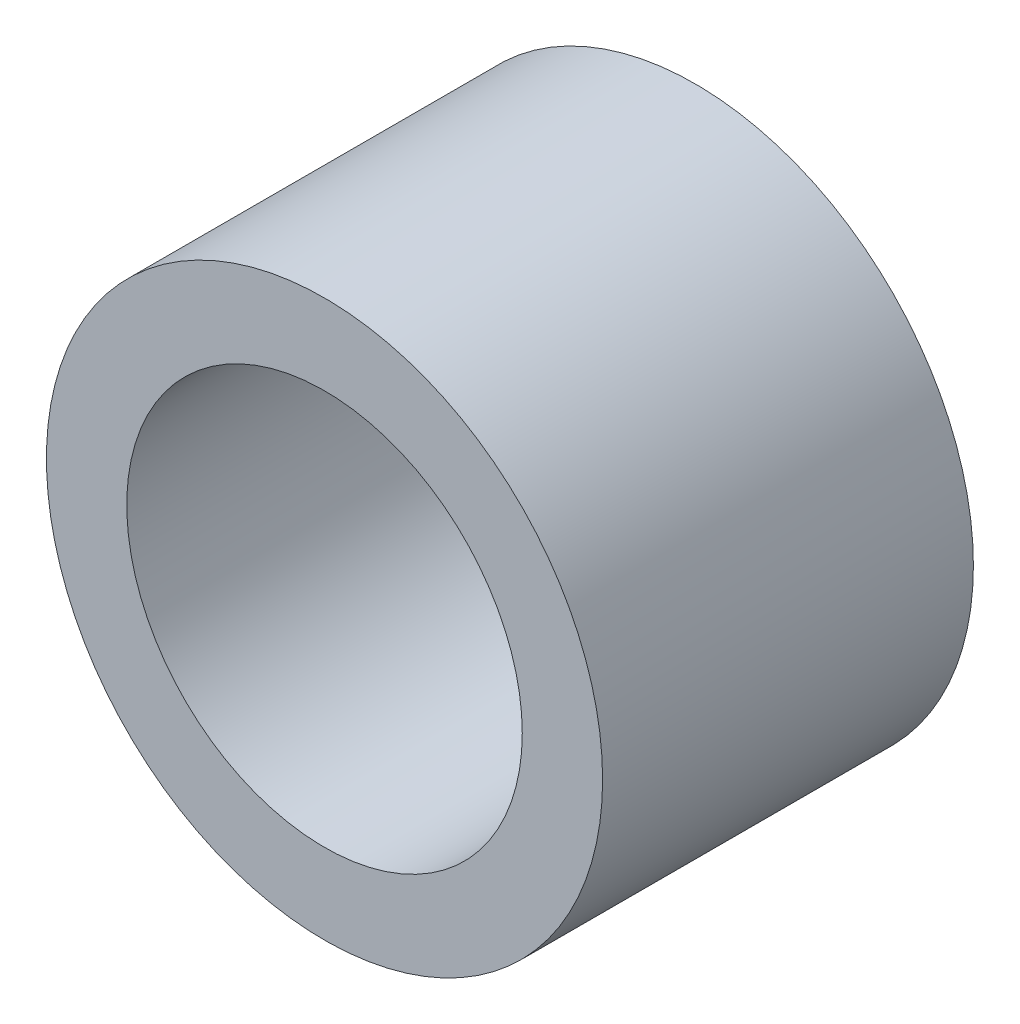
ISO-10303-21;
HEADER;
FILE_DESCRIPTION(('STEP AP214'),'2;1');
FILE_NAME('part.step','',(''),(''),'','','');
FILE_SCHEMA(('AUTOMOTIVE_DESIGN { 1 0 10303 214 1 1 1 1 }'));
ENDSEC;
DATA;
#1=APPLICATION_CONTEXT('core data for automotive mechanical design processes');
#2=APPLICATION_PROTOCOL_DEFINITION('international standard','automotive_design',2000,#1);
#3=PRODUCT_CONTEXT('',#1,'mechanical');
#4=PRODUCT('Part','Part','',(#3));
#5=PRODUCT_RELATED_PRODUCT_CATEGORY('part','',(#4));
#6=PRODUCT_DEFINITION_FORMATION('','',#4);
#7=PRODUCT_DEFINITION_CONTEXT('part definition',#1,'design');
#8=PRODUCT_DEFINITION('design','',#6,#7);
#9=PRODUCT_DEFINITION_SHAPE('','',#8);
#10=(LENGTH_UNIT() NAMED_UNIT(*) SI_UNIT(.MILLI.,.METRE.));
#11=(NAMED_UNIT(*) PLANE_ANGLE_UNIT() SI_UNIT($,.RADIAN.));
#12=(NAMED_UNIT(*) SI_UNIT($,.STERADIAN.) SOLID_ANGLE_UNIT());
#13=UNCERTAINTY_MEASURE_WITH_UNIT(LENGTH_MEASURE(1.E-05),#10,'distance_accuracy_value','');
#14=(GEOMETRIC_REPRESENTATION_CONTEXT(3) GLOBAL_UNCERTAINTY_ASSIGNED_CONTEXT((#13)) GLOBAL_UNIT_ASSIGNED_CONTEXT((#10,
#11,#12)) REPRESENTATION_CONTEXT('',''));
#15=CARTESIAN_POINT('',(0.,0.,0.));
#16=DIRECTION('',(0.,0.,1.));
#17=DIRECTION('',(1.,0.,0.));
#18=AXIS2_PLACEMENT_3D('',#15,#16,#17);
#19=CARTESIAN_POINT('',(0.,0.,1.5));
#20=DIRECTION('',(0.,0.,1.));
#21=DIRECTION('',(1.,0.,0.));
#22=AXIS2_PLACEMENT_3D('',#19,#20,#21);
#23=PLANE('',#22);
#24=CARTESIAN_POINT('',(0.,0.,1.5));
#25=DIRECTION('',(0.,0.,1.));
#26=DIRECTION('',(1.,0.,0.));
#27=AXIS2_PLACEMENT_3D('',#24,#25,#26);
#28=CIRCLE('',#27,2.25);
#29=CARTESIAN_POINT('',(2.25,0.,1.5));
#30=VERTEX_POINT('',#29);
#31=EDGE_CURVE('E10',#30,#30,#28,.T.);
#32=ORIENTED_EDGE('',*,*,#31,.T.);
#33=EDGE_LOOP('',(#32));
#34=FACE_BOUND('',#33,.T.);
#35=CARTESIAN_POINT('',(0.,0.,1.5));
#36=DIRECTION('',(0.,0.,1.));
#37=DIRECTION('',(1.,0.,0.));
#38=AXIS2_PLACEMENT_3D('',#35,#36,#37);
#39=CIRCLE('',#38,1.6);
#40=CARTESIAN_POINT('',(1.6,0.,1.5));
#41=VERTEX_POINT('',#40);
#42=EDGE_CURVE('E37',#41,#41,#39,.T.);
#43=ORIENTED_EDGE('',*,*,#42,.F.);
#44=EDGE_LOOP('',(#43));
#45=FACE_BOUND('',#44,.T.);
#46=ADVANCED_FACE('F30',(#34,#45),#23,.T.);
#47=CARTESIAN_POINT('',(0.,0.,1.5));
#48=DIRECTION('',(0.,0.,-1.));
#49=DIRECTION('',(-1.,0.,0.));
#50=AXIS2_PLACEMENT_3D('',#47,#48,#49);
#51=CYLINDRICAL_SURFACE('',#50,2.25);
#52=ORIENTED_EDGE('',*,*,#31,.F.);
#53=EDGE_LOOP('',(#52));
#54=FACE_BOUND('',#53,.T.);
#55=CARTESIAN_POINT('',(0.,0.,-1.5));
#56=DIRECTION('',(0.,0.,1.));
#57=DIRECTION('',(1.,0.,0.));
#58=AXIS2_PLACEMENT_3D('',#55,#56,#57);
#59=CIRCLE('',#58,2.25);
#60=CARTESIAN_POINT('',(2.25,0.,-1.5));
#61=VERTEX_POINT('',#60);
#62=EDGE_CURVE('E41',#61,#61,#59,.T.);
#63=ORIENTED_EDGE('',*,*,#62,.T.);
#64=EDGE_LOOP('',(#63));
#65=FACE_BOUND('',#64,.T.);
#66=ADVANCED_FACE('F32',(#54,#65),#51,.T.);
#67=CARTESIAN_POINT('',(0.,0.,1.5));
#68=DIRECTION('',(0.,0.,-1.));
#69=DIRECTION('',(-1.,0.,0.));
#70=AXIS2_PLACEMENT_3D('',#67,#68,#69);
#71=CYLINDRICAL_SURFACE('',#70,1.6);
#72=ORIENTED_EDGE('',*,*,#42,.T.);
#73=EDGE_LOOP('',(#72));
#74=FACE_BOUND('',#73,.T.);
#75=CARTESIAN_POINT('',(0.,0.,-1.5));
#76=DIRECTION('',(0.,0.,1.));
#77=DIRECTION('',(1.,0.,0.));
#78=AXIS2_PLACEMENT_3D('',#75,#76,#77);
#79=CIRCLE('',#78,1.6);
#80=CARTESIAN_POINT('',(1.6,0.,-1.5));
#81=VERTEX_POINT('',#80);
#82=EDGE_CURVE('E45',#81,#81,#79,.T.);
#83=ORIENTED_EDGE('',*,*,#82,.F.);
#84=EDGE_LOOP('',(#83));
#85=FACE_BOUND('',#84,.T.);
#86=ADVANCED_FACE('F54',(#74,#85),#71,.F.);
#87=CARTESIAN_POINT('',(0.,0.,-1.5));
#88=DIRECTION('',(0.,0.,1.));
#89=DIRECTION('',(1.,0.,0.));
#90=AXIS2_PLACEMENT_3D('',#87,#88,#89);
#91=PLANE('',#90);
#92=ORIENTED_EDGE('',*,*,#82,.T.);
#93=EDGE_LOOP('',(#92));
#94=FACE_BOUND('',#93,.T.);
#95=ORIENTED_EDGE('',*,*,#62,.F.);
#96=EDGE_LOOP('',(#95));
#97=FACE_BOUND('',#96,.T.);
#98=ADVANCED_FACE('F51',(#94,#97),#91,.F.);
#99=CLOSED_SHELL('',(#46,#66,#86,#98));
#100=MANIFOLD_SOLID_BREP('B2',#99);
#101=ADVANCED_BREP_SHAPE_REPRESENTATION('',(#18,#100),#14);
#102=SHAPE_DEFINITION_REPRESENTATION(#9,#101);
ENDSEC;
END-ISO-10303-21;
